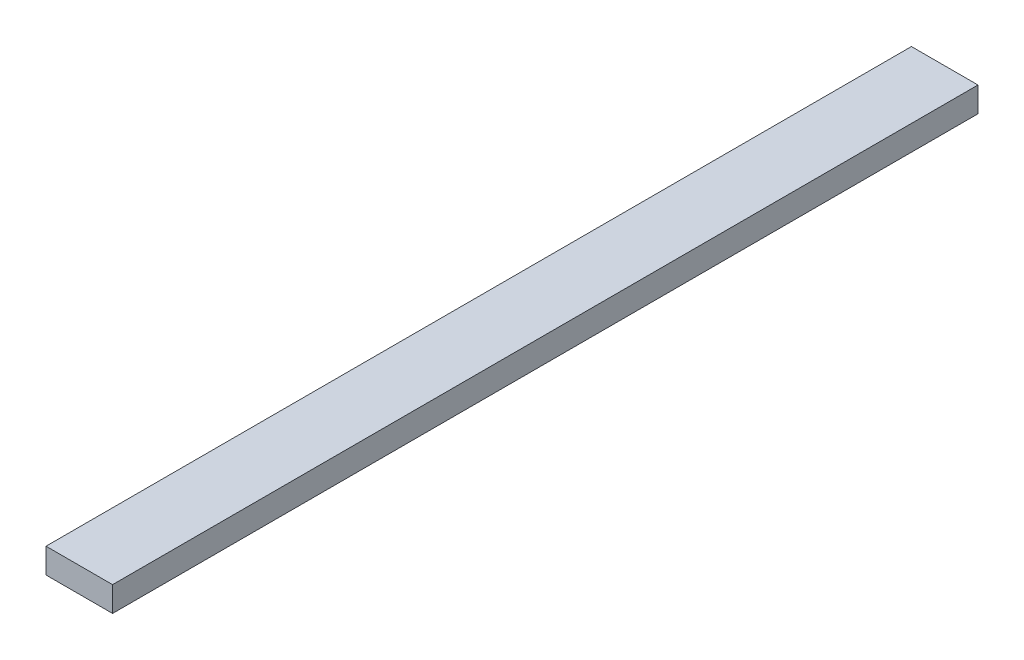
ISO-10303-21;
HEADER;
FILE_DESCRIPTION(('STEP AP214'),'2;1');
FILE_NAME('part.step','',(''),(''),'','','');
FILE_SCHEMA(('AUTOMOTIVE_DESIGN { 1 0 10303 214 1 1 1 1 }'));
ENDSEC;
DATA;
#1=APPLICATION_CONTEXT('core data for automotive mechanical design processes');
#2=APPLICATION_PROTOCOL_DEFINITION('international standard','automotive_design',2000,#1);
#3=PRODUCT_CONTEXT('',#1,'mechanical');
#4=PRODUCT('Part','Part','',(#3));
#5=PRODUCT_RELATED_PRODUCT_CATEGORY('part','',(#4));
#6=PRODUCT_DEFINITION_FORMATION('','',#4);
#7=PRODUCT_DEFINITION_CONTEXT('part definition',#1,'design');
#8=PRODUCT_DEFINITION('design','',#6,#7);
#9=PRODUCT_DEFINITION_SHAPE('','',#8);
#10=(LENGTH_UNIT() NAMED_UNIT(*) SI_UNIT(.MILLI.,.METRE.));
#11=(NAMED_UNIT(*) PLANE_ANGLE_UNIT() SI_UNIT($,.RADIAN.));
#12=(NAMED_UNIT(*) SI_UNIT($,.STERADIAN.) SOLID_ANGLE_UNIT());
#13=UNCERTAINTY_MEASURE_WITH_UNIT(LENGTH_MEASURE(1.E-05),#10,'distance_accuracy_value','');
#14=(GEOMETRIC_REPRESENTATION_CONTEXT(3) GLOBAL_UNCERTAINTY_ASSIGNED_CONTEXT((#13)) GLOBAL_UNIT_ASSIGNED_CONTEXT((#10,
#11,#12)) REPRESENTATION_CONTEXT('',''));
#15=CARTESIAN_POINT('',(0.,0.,0.));
#16=DIRECTION('',(0.,0.,1.));
#17=DIRECTION('',(1.,0.,0.));
#18=AXIS2_PLACEMENT_3D('',#15,#16,#17);
#19=CARTESIAN_POINT('',(0.,15.,0.));
#20=DIRECTION('',(1.,0.,0.));
#21=DIRECTION('',(0.,0.,-1.));
#22=AXIS2_PLACEMENT_3D('',#19,#20,#21);
#23=PLANE('',#22);
#24=DIRECTION('',(0.,0.,1.));
#25=VECTOR('',#24,1.);
#26=CARTESIAN_POINT('',(0.,0.,0.));
#27=LINE('',#26,#25);
#28=CARTESIAN_POINT('',(0.,0.,-520.));
#29=VERTEX_POINT('',#28);
#30=CARTESIAN_POINT('',(0.,0.,0.));
#31=VERTEX_POINT('',#30);
#32=EDGE_CURVE('E107',#29,#31,#27,.T.);
#33=ORIENTED_EDGE('',*,*,#32,.T.);
#34=DIRECTION('',(0.,-1.,0.));
#35=VECTOR('',#34,1.);
#36=CARTESIAN_POINT('',(0.,15.,0.));
#37=LINE('',#36,#35);
#38=CARTESIAN_POINT('',(0.,15.,0.));
#39=VERTEX_POINT('',#38);
#40=EDGE_CURVE('E11',#39,#31,#37,.T.);
#41=ORIENTED_EDGE('',*,*,#40,.F.);
#42=DIRECTION('',(0.,0.,1.));
#43=VECTOR('',#42,1.);
#44=CARTESIAN_POINT('',(0.,15.,0.));
#45=LINE('',#44,#43);
#46=CARTESIAN_POINT('',(0.,15.,-520.));
#47=VERTEX_POINT('',#46);
#48=EDGE_CURVE('E91',#47,#39,#45,.T.);
#49=ORIENTED_EDGE('',*,*,#48,.F.);
#50=DIRECTION('',(0.,-1.,0.));
#51=VECTOR('',#50,1.);
#52=CARTESIAN_POINT('',(0.,15.,-520.));
#53=LINE('',#52,#51);
#54=EDGE_CURVE('E103',#47,#29,#53,.T.);
#55=ORIENTED_EDGE('',*,*,#54,.T.);
#56=EDGE_LOOP('',(#33,#41,#49,#55));
#57=FACE_BOUND('',#56,.T.);
#58=ADVANCED_FACE('F39',(#57),#23,.F.);
#59=CARTESIAN_POINT('',(0.,15.,0.));
#60=DIRECTION('',(0.,0.,-1.));
#61=DIRECTION('',(-1.,0.,0.));
#62=AXIS2_PLACEMENT_3D('',#59,#60,#61);
#63=PLANE('',#62);
#64=DIRECTION('',(1.,0.,0.));
#65=VECTOR('',#64,1.);
#66=CARTESIAN_POINT('',(0.,0.,0.));
#67=LINE('',#66,#65);
#68=CARTESIAN_POINT('',(40.,0.,0.));
#69=VERTEX_POINT('',#68);
#70=EDGE_CURVE('E96',#31,#69,#67,.T.);
#71=ORIENTED_EDGE('',*,*,#70,.T.);
#72=DIRECTION('',(0.,-1.,0.));
#73=VECTOR('',#72,1.);
#74=CARTESIAN_POINT('',(40.,15.,0.));
#75=LINE('',#74,#73);
#76=CARTESIAN_POINT('',(40.,15.,0.));
#77=VERTEX_POINT('',#76);
#78=EDGE_CURVE('E48',#77,#69,#75,.T.);
#79=ORIENTED_EDGE('',*,*,#78,.F.);
#80=DIRECTION('',(1.,0.,0.));
#81=VECTOR('',#80,1.);
#82=CARTESIAN_POINT('',(0.,15.,0.));
#83=LINE('',#82,#81);
#84=EDGE_CURVE('E86',#39,#77,#83,.T.);
#85=ORIENTED_EDGE('',*,*,#84,.F.);
#86=ORIENTED_EDGE('',*,*,#40,.T.);
#87=EDGE_LOOP('',(#71,#79,#85,#86));
#88=FACE_BOUND('',#87,.T.);
#89=ADVANCED_FACE('F95',(#88),#63,.F.);
#90=CARTESIAN_POINT('',(40.,15.,0.));
#91=DIRECTION('',(-1.,0.,0.));
#92=DIRECTION('',(0.,0.,1.));
#93=AXIS2_PLACEMENT_3D('',#90,#91,#92);
#94=PLANE('',#93);
#95=DIRECTION('',(0.,0.,-1.));
#96=VECTOR('',#95,1.);
#97=CARTESIAN_POINT('',(40.,0.,0.));
#98=LINE('',#97,#96);
#99=CARTESIAN_POINT('',(40.,0.,-520.));
#100=VERTEX_POINT('',#99);
#101=EDGE_CURVE('E73',#69,#100,#98,.T.);
#102=ORIENTED_EDGE('',*,*,#101,.T.);
#103=DIRECTION('',(0.,-1.,0.));
#104=VECTOR('',#103,1.);
#105=CARTESIAN_POINT('',(40.,15.,-520.));
#106=LINE('',#105,#104);
#107=CARTESIAN_POINT('',(40.,15.,-520.));
#108=VERTEX_POINT('',#107);
#109=EDGE_CURVE('E98',#108,#100,#106,.T.);
#110=ORIENTED_EDGE('',*,*,#109,.F.);
#111=DIRECTION('',(0.,0.,-1.));
#112=VECTOR('',#111,1.);
#113=CARTESIAN_POINT('',(40.,15.,0.));
#114=LINE('',#113,#112);
#115=EDGE_CURVE('E89',#77,#108,#114,.T.);
#116=ORIENTED_EDGE('',*,*,#115,.F.);
#117=ORIENTED_EDGE('',*,*,#78,.T.);
#118=EDGE_LOOP('',(#102,#110,#116,#117));
#119=FACE_BOUND('',#118,.T.);
#120=ADVANCED_FACE('F99',(#119),#94,.F.);
#121=CARTESIAN_POINT('',(0.,15.,-520.));
#122=DIRECTION('',(0.,0.,1.));
#123=DIRECTION('',(1.,0.,0.));
#124=AXIS2_PLACEMENT_3D('',#121,#122,#123);
#125=PLANE('',#124);
#126=DIRECTION('',(-1.,0.,0.));
#127=VECTOR('',#126,1.);
#128=CARTESIAN_POINT('',(0.,0.,-520.));
#129=LINE('',#128,#127);
#130=EDGE_CURVE('E79',#100,#29,#129,.T.);
#131=ORIENTED_EDGE('',*,*,#130,.T.);
#132=ORIENTED_EDGE('',*,*,#54,.F.);
#133=DIRECTION('',(-1.,0.,0.));
#134=VECTOR('',#133,1.);
#135=CARTESIAN_POINT('',(0.,15.,-520.));
#136=LINE('',#135,#134);
#137=EDGE_CURVE('E56',#108,#47,#136,.T.);
#138=ORIENTED_EDGE('',*,*,#137,.F.);
#139=ORIENTED_EDGE('',*,*,#109,.T.);
#140=EDGE_LOOP('',(#131,#132,#138,#139));
#141=FACE_BOUND('',#140,.T.);
#142=ADVANCED_FACE('F120',(#141),#125,.F.);
#143=CARTESIAN_POINT('',(0.,15.,0.));
#144=DIRECTION('',(0.,-1.,0.));
#145=DIRECTION('',(0.,0.,-1.));
#146=AXIS2_PLACEMENT_3D('',#143,#144,#145);
#147=PLANE('',#146);
#148=ORIENTED_EDGE('',*,*,#48,.T.);
#149=ORIENTED_EDGE('',*,*,#84,.T.);
#150=ORIENTED_EDGE('',*,*,#115,.T.);
#151=ORIENTED_EDGE('',*,*,#137,.T.);
#152=EDGE_LOOP('',(#148,#149,#150,#151));
#153=FACE_BOUND('',#152,.T.);
#154=ADVANCED_FACE('F87',(#153),#147,.F.);
#155=CARTESIAN_POINT('',(0.,0.,0.));
#156=DIRECTION('',(0.,-1.,0.));
#157=DIRECTION('',(0.,0.,-1.));
#158=AXIS2_PLACEMENT_3D('',#155,#156,#157);
#159=PLANE('',#158);
#160=ORIENTED_EDGE('',*,*,#32,.F.);
#161=ORIENTED_EDGE('',*,*,#130,.F.);
#162=ORIENTED_EDGE('',*,*,#101,.F.);
#163=ORIENTED_EDGE('',*,*,#70,.F.);
#164=EDGE_LOOP('',(#160,#161,#162,#163));
#165=FACE_BOUND('',#164,.T.);
#166=ADVANCED_FACE('F123',(#165),#159,.T.);
#167=CLOSED_SHELL('',(#58,#89,#120,#142,#154,#166));
#168=MANIFOLD_SOLID_BREP('B2',#167);
#169=ADVANCED_BREP_SHAPE_REPRESENTATION('',(#18,#168),#14);
#170=SHAPE_DEFINITION_REPRESENTATION(#9,#169);
ENDSEC;
END-ISO-10303-21;
